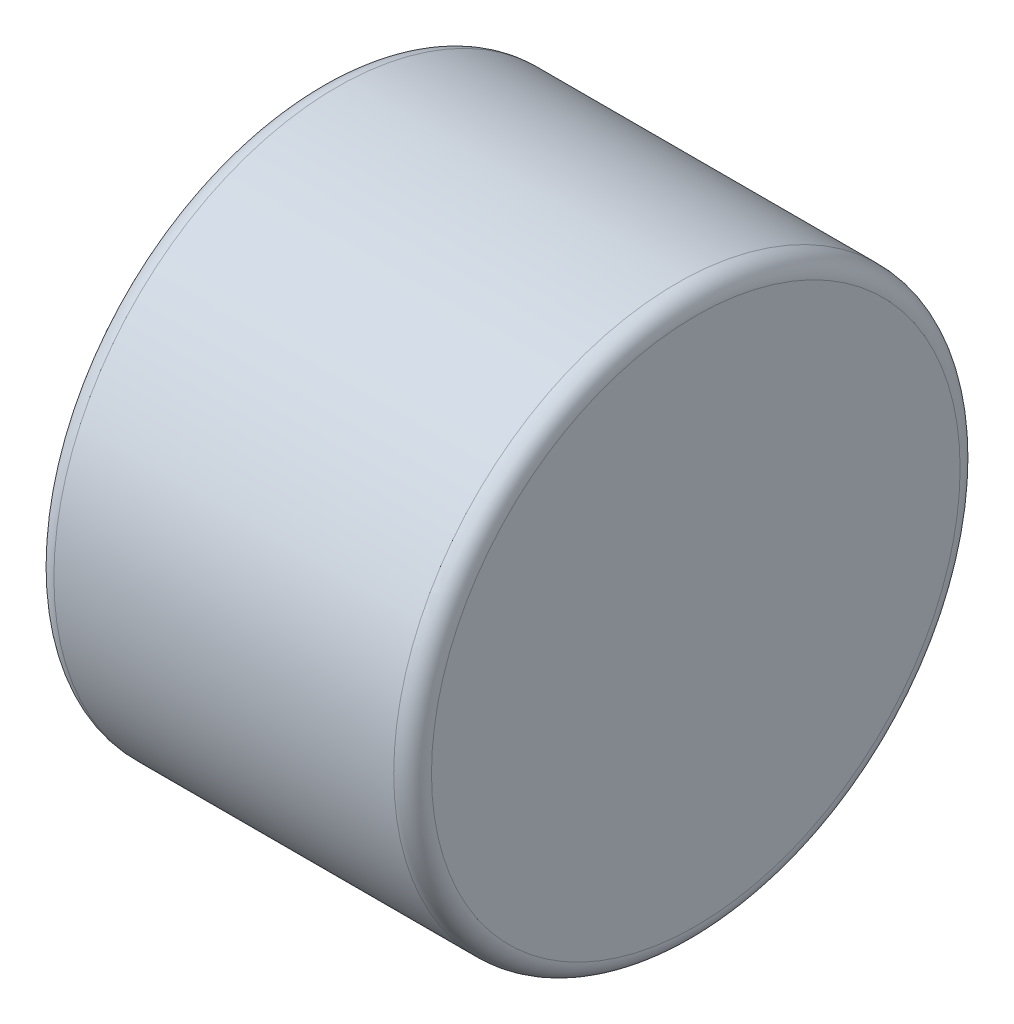
ISO-10303-21;
HEADER;
FILE_DESCRIPTION(('STEP AP214'),'2;1');
FILE_NAME('part.step','',(''),(''),'','','');
FILE_SCHEMA(('AUTOMOTIVE_DESIGN { 1 0 10303 214 1 1 1 1 }'));
ENDSEC;
DATA;
#1=APPLICATION_CONTEXT('core data for automotive mechanical design processes');
#2=APPLICATION_PROTOCOL_DEFINITION('international standard','automotive_design',2000,#1);
#3=PRODUCT_CONTEXT('',#1,'mechanical');
#4=PRODUCT('Part','Part','',(#3));
#5=PRODUCT_RELATED_PRODUCT_CATEGORY('part','',(#4));
#6=PRODUCT_DEFINITION_FORMATION('','',#4);
#7=PRODUCT_DEFINITION_CONTEXT('part definition',#1,'design');
#8=PRODUCT_DEFINITION('design','',#6,#7);
#9=PRODUCT_DEFINITION_SHAPE('','',#8);
#10=(LENGTH_UNIT() NAMED_UNIT(*) SI_UNIT(.MILLI.,.METRE.));
#11=(NAMED_UNIT(*) PLANE_ANGLE_UNIT() SI_UNIT($,.RADIAN.));
#12=(NAMED_UNIT(*) SI_UNIT($,.STERADIAN.) SOLID_ANGLE_UNIT());
#13=UNCERTAINTY_MEASURE_WITH_UNIT(LENGTH_MEASURE(1.E-05),#10,'distance_accuracy_value','');
#14=(GEOMETRIC_REPRESENTATION_CONTEXT(3) GLOBAL_UNCERTAINTY_ASSIGNED_CONTEXT((#13)) GLOBAL_UNIT_ASSIGNED_CONTEXT((#10,
#11,#12)) REPRESENTATION_CONTEXT('',''));
#15=CARTESIAN_POINT('',(0.,0.,0.));
#16=DIRECTION('',(0.,0.,1.));
#17=DIRECTION('',(1.,0.,0.));
#18=AXIS2_PLACEMENT_3D('',#15,#16,#17);
#19=CARTESIAN_POINT('',(2.,0.,0.));
#20=DIRECTION('',(-1.,0.,0.));
#21=DIRECTION('',(0.,0.,1.));
#22=AXIS2_PLACEMENT_3D('',#19,#20,#21);
#23=CYLINDRICAL_SURFACE('',#22,3.);
#24=CARTESIAN_POINT('',(1.8,0.,0.));
#25=DIRECTION('',(1.,0.,0.));
#26=DIRECTION('',(0.,0.,-1.));
#27=AXIS2_PLACEMENT_3D('',#24,#25,#26);
#28=CIRCLE('',#27,3.);
#29=CARTESIAN_POINT('',(1.8,0.,-3.));
#30=VERTEX_POINT('',#29);
#31=EDGE_CURVE('E42',#30,#30,#28,.F.);
#32=ORIENTED_EDGE('',*,*,#31,.T.);
#33=EDGE_LOOP('',(#32));
#34=FACE_BOUND('',#33,.T.);
#35=CARTESIAN_POINT('',(-1.8,0.,0.));
#36=DIRECTION('',(1.,0.,0.));
#37=DIRECTION('',(0.,0.,-1.));
#38=AXIS2_PLACEMENT_3D('',#35,#36,#37);
#39=CIRCLE('',#38,3.);
#40=CARTESIAN_POINT('',(-1.8,0.,-3.));
#41=VERTEX_POINT('',#40);
#42=EDGE_CURVE('E46',#41,#41,#39,.T.);
#43=ORIENTED_EDGE('',*,*,#42,.T.);
#44=EDGE_LOOP('',(#43));
#45=FACE_BOUND('',#44,.T.);
#46=ADVANCED_FACE('F35',(#34,#45),#23,.T.);
#47=CARTESIAN_POINT('',(2.,0.,0.));
#48=DIRECTION('',(1.,0.,0.));
#49=DIRECTION('',(0.,0.,-1.));
#50=AXIS2_PLACEMENT_3D('',#47,#48,#49);
#51=PLANE('',#50);
#52=CARTESIAN_POINT('',(2.,0.,0.));
#53=DIRECTION('',(1.,0.,0.));
#54=DIRECTION('',(0.,0.,-1.));
#55=AXIS2_PLACEMENT_3D('',#52,#53,#54);
#56=CIRCLE('',#55,2.8);
#57=CARTESIAN_POINT('',(2.,0.,-2.8));
#58=VERTEX_POINT('',#57);
#59=EDGE_CURVE('E50',#58,#58,#56,.T.);
#60=ORIENTED_EDGE('',*,*,#59,.T.);
#61=EDGE_LOOP('',(#60));
#62=FACE_BOUND('',#61,.T.);
#63=ADVANCED_FACE('F56',(#62),#51,.T.);
#64=CARTESIAN_POINT('',(-2.,0.,0.));
#65=DIRECTION('',(1.,0.,0.));
#66=DIRECTION('',(0.,0.,-1.));
#67=AXIS2_PLACEMENT_3D('',#64,#65,#66);
#68=PLANE('',#67);
#69=CARTESIAN_POINT('',(-2.,0.,0.));
#70=DIRECTION('',(1.,0.,0.));
#71=DIRECTION('',(0.,0.,-1.));
#72=AXIS2_PLACEMENT_3D('',#69,#70,#71);
#73=CIRCLE('',#72,2.8);
#74=CARTESIAN_POINT('',(-2.,0.,-2.8));
#75=VERTEX_POINT('',#74);
#76=EDGE_CURVE('E10',#75,#75,#73,.F.);
#77=ORIENTED_EDGE('',*,*,#76,.T.);
#78=EDGE_LOOP('',(#77));
#79=FACE_BOUND('',#78,.T.);
#80=ADVANCED_FACE('F60',(#79),#68,.F.);
#81=CARTESIAN_POINT('',(1.8,0.,0.));
#82=DIRECTION('',(1.,0.,0.));
#83=DIRECTION('',(0.,0.,-1.));
#84=AXIS2_PLACEMENT_3D('',#81,#82,#83);
#85=TOROIDAL_SURFACE('',#84,2.8,0.2);
#86=ORIENTED_EDGE('',*,*,#31,.F.);
#87=EDGE_LOOP('',(#86));
#88=FACE_BOUND('',#87,.T.);
#89=ORIENTED_EDGE('',*,*,#59,.F.);
#90=EDGE_LOOP('',(#89));
#91=FACE_BOUND('',#90,.T.);
#92=ADVANCED_FACE('F58',(#88,#91),#85,.T.);
#93=CARTESIAN_POINT('',(-1.8,0.,0.));
#94=DIRECTION('',(1.,0.,0.));
#95=DIRECTION('',(0.,0.,-1.));
#96=AXIS2_PLACEMENT_3D('',#93,#94,#95);
#97=TOROIDAL_SURFACE('',#96,2.8,0.2);
#98=ORIENTED_EDGE('',*,*,#76,.F.);
#99=EDGE_LOOP('',(#98));
#100=FACE_BOUND('',#99,.T.);
#101=ORIENTED_EDGE('',*,*,#42,.F.);
#102=EDGE_LOOP('',(#101));
#103=FACE_BOUND('',#102,.T.);
#104=ADVANCED_FACE('F37',(#100,#103),#97,.T.);
#105=CLOSED_SHELL('',(#46,#63,#80,#92,#104));
#106=MANIFOLD_SOLID_BREP('B2',#105);
#107=ADVANCED_BREP_SHAPE_REPRESENTATION('',(#18,#106),#14);
#108=SHAPE_DEFINITION_REPRESENTATION(#9,#107);
ENDSEC;
END-ISO-10303-21;
